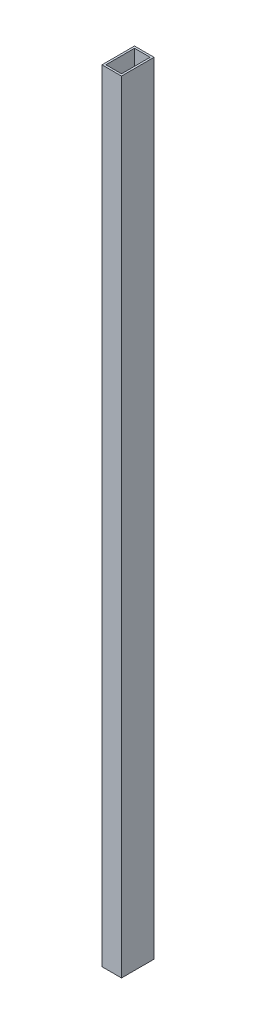
ISO-10303-21;
HEADER;
FILE_DESCRIPTION(('STEP AP214'),'2;1');
FILE_NAME('part.step','',(''),(''),'','','');
FILE_SCHEMA(('AUTOMOTIVE_DESIGN { 1 0 10303 214 1 1 1 1 }'));
ENDSEC;
DATA;
#1=APPLICATION_CONTEXT('core data for automotive mechanical design processes');
#2=APPLICATION_PROTOCOL_DEFINITION('international standard','automotive_design',2000,#1);
#3=PRODUCT_CONTEXT('',#1,'mechanical');
#4=PRODUCT('Part','Part','',(#3));
#5=PRODUCT_RELATED_PRODUCT_CATEGORY('part','',(#4));
#6=PRODUCT_DEFINITION_FORMATION('','',#4);
#7=PRODUCT_DEFINITION_CONTEXT('part definition',#1,'design');
#8=PRODUCT_DEFINITION('design','',#6,#7);
#9=PRODUCT_DEFINITION_SHAPE('','',#8);
#10=(LENGTH_UNIT() NAMED_UNIT(*) SI_UNIT(.MILLI.,.METRE.));
#11=(NAMED_UNIT(*) PLANE_ANGLE_UNIT() SI_UNIT($,.RADIAN.));
#12=(NAMED_UNIT(*) SI_UNIT($,.STERADIAN.) SOLID_ANGLE_UNIT());
#13=UNCERTAINTY_MEASURE_WITH_UNIT(LENGTH_MEASURE(1.E-05),#10,'distance_accuracy_value','');
#14=(GEOMETRIC_REPRESENTATION_CONTEXT(3) GLOBAL_UNCERTAINTY_ASSIGNED_CONTEXT((#13)) GLOBAL_UNIT_ASSIGNED_CONTEXT((#10,
#11,#12)) REPRESENTATION_CONTEXT('',''));
#15=CARTESIAN_POINT('',(0.,0.,0.));
#16=DIRECTION('',(0.,0.,1.));
#17=DIRECTION('',(1.,0.,0.));
#18=AXIS2_PLACEMENT_3D('',#15,#16,#17);
#19=CARTESIAN_POINT('',(0.,3048.,-127.));
#20=DIRECTION('',(0.,-1.,0.));
#21=DIRECTION('',(0.,0.,-1.));
#22=AXIS2_PLACEMENT_3D('',#19,#20,#21);
#23=PLANE('',#22);
#24=DIRECTION('',(0.,0.,1.));
#25=VECTOR('',#24,1.);
#26=CARTESIAN_POINT('',(0.,3048.,0.));
#27=LINE('',#26,#25);
#28=CARTESIAN_POINT('',(0.,3048.,-127.));
#29=VERTEX_POINT('',#28);
#30=CARTESIAN_POINT('',(0.,3048.,0.));
#31=VERTEX_POINT('',#30);
#32=EDGE_CURVE('E134',#29,#31,#27,.T.);
#33=ORIENTED_EDGE('',*,*,#32,.T.);
#34=DIRECTION('',(1.,0.,0.));
#35=VECTOR('',#34,1.);
#36=CARTESIAN_POINT('',(0.,3048.,0.));
#37=LINE('',#36,#35);
#38=CARTESIAN_POINT('',(76.2,3048.,0.));
#39=VERTEX_POINT('',#38);
#40=EDGE_CURVE('E137',#31,#39,#37,.T.);
#41=ORIENTED_EDGE('',*,*,#40,.T.);
#42=DIRECTION('',(0.,0.,-1.));
#43=VECTOR('',#42,1.);
#44=CARTESIAN_POINT('',(76.2,3048.,0.));
#45=LINE('',#44,#43);
#46=CARTESIAN_POINT('',(76.2,3048.,-127.));
#47=VERTEX_POINT('',#46);
#48=EDGE_CURVE('E140',#39,#47,#45,.T.);
#49=ORIENTED_EDGE('',*,*,#48,.T.);
#50=DIRECTION('',(-1.,0.,0.));
#51=VECTOR('',#50,1.);
#52=CARTESIAN_POINT('',(0.,3048.,-127.));
#53=LINE('',#52,#51);
#54=EDGE_CURVE('E142',#47,#29,#53,.T.);
#55=ORIENTED_EDGE('',*,*,#54,.T.);
#56=EDGE_LOOP('',(#33,#41,#49,#55));
#57=FACE_BOUND('',#56,.T.);
#58=DIRECTION('',(0.,0.,1.));
#59=VECTOR('',#58,1.);
#60=CARTESIAN_POINT('',(7.62,3048.,-7.62));
#61=LINE('',#60,#59);
#62=CARTESIAN_POINT('',(7.62,3048.,-119.38));
#63=VERTEX_POINT('',#62);
#64=CARTESIAN_POINT('',(7.62,3048.,-7.62));
#65=VERTEX_POINT('',#64);
#66=EDGE_CURVE('E98',#63,#65,#61,.T.);
#67=ORIENTED_EDGE('',*,*,#66,.F.);
#68=DIRECTION('',(-1.,0.,0.));
#69=VECTOR('',#68,1.);
#70=CARTESIAN_POINT('',(7.62,3048.,-119.38));
#71=LINE('',#70,#69);
#72=CARTESIAN_POINT('',(68.58,3048.,-119.38));
#73=VERTEX_POINT('',#72);
#74=EDGE_CURVE('E120',#73,#63,#71,.T.);
#75=ORIENTED_EDGE('',*,*,#74,.F.);
#76=DIRECTION('',(0.,0.,-1.));
#77=VECTOR('',#76,1.);
#78=CARTESIAN_POINT('',(68.58,3048.,-7.62));
#79=LINE('',#78,#77);
#80=CARTESIAN_POINT('',(68.58,3048.,-7.62));
#81=VERTEX_POINT('',#80);
#82=EDGE_CURVE('E118',#81,#73,#79,.T.);
#83=ORIENTED_EDGE('',*,*,#82,.F.);
#84=DIRECTION('',(1.,0.,0.));
#85=VECTOR('',#84,1.);
#86=CARTESIAN_POINT('',(7.62,3048.,-7.62));
#87=LINE('',#86,#85);
#88=EDGE_CURVE('E106',#65,#81,#87,.T.);
#89=ORIENTED_EDGE('',*,*,#88,.F.);
#90=EDGE_LOOP('',(#67,#75,#83,#89));
#91=FACE_BOUND('',#90,.T.);
#92=ADVANCED_FACE('F33',(#57,#91),#23,.F.);
#93=CARTESIAN_POINT('',(0.,0.,-127.));
#94=DIRECTION('',(0.,-1.,0.));
#95=DIRECTION('',(0.,0.,-1.));
#96=AXIS2_PLACEMENT_3D('',#93,#94,#95);
#97=PLANE('',#96);
#98=DIRECTION('',(0.,0.,1.));
#99=VECTOR('',#98,1.);
#100=CARTESIAN_POINT('',(0.,0.,0.));
#101=LINE('',#100,#99);
#102=CARTESIAN_POINT('',(0.,0.,-127.));
#103=VERTEX_POINT('',#102);
#104=CARTESIAN_POINT('',(0.,0.,0.));
#105=VERTEX_POINT('',#104);
#106=EDGE_CURVE('E114',#103,#105,#101,.T.);
#107=ORIENTED_EDGE('',*,*,#106,.F.);
#108=DIRECTION('',(-1.,0.,0.));
#109=VECTOR('',#108,1.);
#110=CARTESIAN_POINT('',(0.,0.,-127.));
#111=LINE('',#110,#109);
#112=CARTESIAN_POINT('',(76.2,0.,-127.));
#113=VERTEX_POINT('',#112);
#114=EDGE_CURVE('E138',#113,#103,#111,.T.);
#115=ORIENTED_EDGE('',*,*,#114,.F.);
#116=DIRECTION('',(0.,0.,-1.));
#117=VECTOR('',#116,1.);
#118=CARTESIAN_POINT('',(76.2,0.,0.));
#119=LINE('',#118,#117);
#120=CARTESIAN_POINT('',(76.2,0.,0.));
#121=VERTEX_POINT('',#120);
#122=EDGE_CURVE('E149',#121,#113,#119,.T.);
#123=ORIENTED_EDGE('',*,*,#122,.F.);
#124=DIRECTION('',(1.,0.,0.));
#125=VECTOR('',#124,1.);
#126=CARTESIAN_POINT('',(0.,0.,0.));
#127=LINE('',#126,#125);
#128=EDGE_CURVE('E147',#105,#121,#127,.T.);
#129=ORIENTED_EDGE('',*,*,#128,.F.);
#130=EDGE_LOOP('',(#107,#115,#123,#129));
#131=FACE_BOUND('',#130,.T.);
#132=DIRECTION('',(-1.,0.,0.));
#133=VECTOR('',#132,1.);
#134=CARTESIAN_POINT('',(7.62,0.,-119.38));
#135=LINE('',#134,#133);
#136=CARTESIAN_POINT('',(68.58,0.,-119.38));
#137=VERTEX_POINT('',#136);
#138=CARTESIAN_POINT('',(7.62,0.,-119.38));
#139=VERTEX_POINT('',#138);
#140=EDGE_CURVE('E107',#137,#139,#135,.T.);
#141=ORIENTED_EDGE('',*,*,#140,.T.);
#142=DIRECTION('',(0.,0.,1.));
#143=VECTOR('',#142,1.);
#144=CARTESIAN_POINT('',(7.62,0.,-7.62));
#145=LINE('',#144,#143);
#146=CARTESIAN_POINT('',(7.62,0.,-7.62));
#147=VERTEX_POINT('',#146);
#148=EDGE_CURVE('E56',#139,#147,#145,.T.);
#149=ORIENTED_EDGE('',*,*,#148,.T.);
#150=DIRECTION('',(1.,0.,0.));
#151=VECTOR('',#150,1.);
#152=CARTESIAN_POINT('',(7.62,0.,-7.62));
#153=LINE('',#152,#151);
#154=CARTESIAN_POINT('',(68.58,0.,-7.62));
#155=VERTEX_POINT('',#154);
#156=EDGE_CURVE('E113',#147,#155,#153,.T.);
#157=ORIENTED_EDGE('',*,*,#156,.T.);
#158=DIRECTION('',(0.,0.,-1.));
#159=VECTOR('',#158,1.);
#160=CARTESIAN_POINT('',(68.58,0.,-7.62));
#161=LINE('',#160,#159);
#162=EDGE_CURVE('E126',#155,#137,#161,.T.);
#163=ORIENTED_EDGE('',*,*,#162,.T.);
#164=EDGE_LOOP('',(#141,#149,#157,#163));
#165=FACE_BOUND('',#164,.T.);
#166=ADVANCED_FACE('F167',(#131,#165),#97,.T.);
#167=CARTESIAN_POINT('',(0.,3048.,0.));
#168=DIRECTION('',(1.,0.,0.));
#169=DIRECTION('',(0.,0.,-1.));
#170=AXIS2_PLACEMENT_3D('',#167,#168,#169);
#171=PLANE('',#170);
#172=ORIENTED_EDGE('',*,*,#106,.T.);
#173=DIRECTION('',(0.,-1.,0.));
#174=VECTOR('',#173,1.);
#175=CARTESIAN_POINT('',(0.,3048.,0.));
#176=LINE('',#175,#174);
#177=EDGE_CURVE('E11',#31,#105,#176,.T.);
#178=ORIENTED_EDGE('',*,*,#177,.F.);
#179=ORIENTED_EDGE('',*,*,#32,.F.);
#180=DIRECTION('',(0.,-1.,0.));
#181=VECTOR('',#180,1.);
#182=CARTESIAN_POINT('',(0.,3048.,-127.));
#183=LINE('',#182,#181);
#184=EDGE_CURVE('E144',#29,#103,#183,.T.);
#185=ORIENTED_EDGE('',*,*,#184,.T.);
#186=EDGE_LOOP('',(#172,#178,#179,#185));
#187=FACE_BOUND('',#186,.T.);
#188=ADVANCED_FACE('F35',(#187),#171,.F.);
#189=CARTESIAN_POINT('',(0.,3048.,0.));
#190=DIRECTION('',(0.,0.,-1.));
#191=DIRECTION('',(-1.,0.,0.));
#192=AXIS2_PLACEMENT_3D('',#189,#190,#191);
#193=PLANE('',#192);
#194=ORIENTED_EDGE('',*,*,#128,.T.);
#195=DIRECTION('',(0.,-1.,0.));
#196=VECTOR('',#195,1.);
#197=CARTESIAN_POINT('',(76.2,3048.,0.));
#198=LINE('',#197,#196);
#199=EDGE_CURVE('E41',#39,#121,#198,.T.);
#200=ORIENTED_EDGE('',*,*,#199,.F.);
#201=ORIENTED_EDGE('',*,*,#40,.F.);
#202=ORIENTED_EDGE('',*,*,#177,.T.);
#203=EDGE_LOOP('',(#194,#200,#201,#202));
#204=FACE_BOUND('',#203,.T.);
#205=ADVANCED_FACE('F177',(#204),#193,.F.);
#206=CARTESIAN_POINT('',(76.2,3048.,0.));
#207=DIRECTION('',(-1.,0.,0.));
#208=DIRECTION('',(0.,0.,1.));
#209=AXIS2_PLACEMENT_3D('',#206,#207,#208);
#210=PLANE('',#209);
#211=ORIENTED_EDGE('',*,*,#122,.T.);
#212=DIRECTION('',(0.,-1.,0.));
#213=VECTOR('',#212,1.);
#214=CARTESIAN_POINT('',(76.2,3048.,-127.));
#215=LINE('',#214,#213);
#216=EDGE_CURVE('E154',#47,#113,#215,.T.);
#217=ORIENTED_EDGE('',*,*,#216,.F.);
#218=ORIENTED_EDGE('',*,*,#48,.F.);
#219=ORIENTED_EDGE('',*,*,#199,.T.);
#220=EDGE_LOOP('',(#211,#217,#218,#219));
#221=FACE_BOUND('',#220,.T.);
#222=ADVANCED_FACE('F161',(#221),#210,.F.);
#223=CARTESIAN_POINT('',(0.,3048.,-127.));
#224=DIRECTION('',(0.,0.,1.));
#225=DIRECTION('',(1.,0.,0.));
#226=AXIS2_PLACEMENT_3D('',#223,#224,#225);
#227=PLANE('',#226);
#228=ORIENTED_EDGE('',*,*,#114,.T.);
#229=ORIENTED_EDGE('',*,*,#184,.F.);
#230=ORIENTED_EDGE('',*,*,#54,.F.);
#231=ORIENTED_EDGE('',*,*,#216,.T.);
#232=EDGE_LOOP('',(#228,#229,#230,#231));
#233=FACE_BOUND('',#232,.T.);
#234=ADVANCED_FACE('F171',(#233),#227,.F.);
#235=CARTESIAN_POINT('',(7.62,3048.,-7.62));
#236=DIRECTION('',(1.,0.,0.));
#237=DIRECTION('',(0.,0.,-1.));
#238=AXIS2_PLACEMENT_3D('',#235,#236,#237);
#239=PLANE('',#238);
#240=ORIENTED_EDGE('',*,*,#148,.F.);
#241=DIRECTION('',(0.,-1.,0.));
#242=VECTOR('',#241,1.);
#243=CARTESIAN_POINT('',(7.62,3048.,-119.38));
#244=LINE('',#243,#242);
#245=EDGE_CURVE('E102',#63,#139,#244,.T.);
#246=ORIENTED_EDGE('',*,*,#245,.F.);
#247=ORIENTED_EDGE('',*,*,#66,.T.);
#248=DIRECTION('',(0.,-1.,0.));
#249=VECTOR('',#248,1.);
#250=CARTESIAN_POINT('',(7.62,3048.,-7.62));
#251=LINE('',#250,#249);
#252=EDGE_CURVE('E101',#65,#147,#251,.T.);
#253=ORIENTED_EDGE('',*,*,#252,.T.);
#254=EDGE_LOOP('',(#240,#246,#247,#253));
#255=FACE_BOUND('',#254,.T.);
#256=ADVANCED_FACE('F100',(#255),#239,.T.);
#257=CARTESIAN_POINT('',(7.62,3048.,-7.62));
#258=DIRECTION('',(0.,0.,-1.));
#259=DIRECTION('',(-1.,0.,0.));
#260=AXIS2_PLACEMENT_3D('',#257,#258,#259);
#261=PLANE('',#260);
#262=ORIENTED_EDGE('',*,*,#156,.F.);
#263=ORIENTED_EDGE('',*,*,#252,.F.);
#264=ORIENTED_EDGE('',*,*,#88,.T.);
#265=DIRECTION('',(0.,-1.,0.));
#266=VECTOR('',#265,1.);
#267=CARTESIAN_POINT('',(68.58,3048.,-7.62));
#268=LINE('',#267,#266);
#269=EDGE_CURVE('E115',#81,#155,#268,.T.);
#270=ORIENTED_EDGE('',*,*,#269,.T.);
#271=EDGE_LOOP('',(#262,#263,#264,#270));
#272=FACE_BOUND('',#271,.T.);
#273=ADVANCED_FACE('F110',(#272),#261,.T.);
#274=CARTESIAN_POINT('',(68.58,3048.,-7.62));
#275=DIRECTION('',(-1.,0.,0.));
#276=DIRECTION('',(0.,0.,1.));
#277=AXIS2_PLACEMENT_3D('',#274,#275,#276);
#278=PLANE('',#277);
#279=ORIENTED_EDGE('',*,*,#162,.F.);
#280=ORIENTED_EDGE('',*,*,#269,.F.);
#281=ORIENTED_EDGE('',*,*,#82,.T.);
#282=DIRECTION('',(0.,-1.,0.));
#283=VECTOR('',#282,1.);
#284=CARTESIAN_POINT('',(68.58,3048.,-119.38));
#285=LINE('',#284,#283);
#286=EDGE_CURVE('E48',#73,#137,#285,.T.);
#287=ORIENTED_EDGE('',*,*,#286,.T.);
#288=EDGE_LOOP('',(#279,#280,#281,#287));
#289=FACE_BOUND('',#288,.T.);
#290=ADVANCED_FACE('F200',(#289),#278,.T.);
#291=CARTESIAN_POINT('',(7.62,3048.,-119.38));
#292=DIRECTION('',(0.,0.,1.));
#293=DIRECTION('',(1.,0.,0.));
#294=AXIS2_PLACEMENT_3D('',#291,#292,#293);
#295=PLANE('',#294);
#296=ORIENTED_EDGE('',*,*,#140,.F.);
#297=ORIENTED_EDGE('',*,*,#286,.F.);
#298=ORIENTED_EDGE('',*,*,#74,.T.);
#299=ORIENTED_EDGE('',*,*,#245,.T.);
#300=EDGE_LOOP('',(#296,#297,#298,#299));
#301=FACE_BOUND('',#300,.T.);
#302=ADVANCED_FACE('F204',(#301),#295,.T.);
#303=CLOSED_SHELL('',(#92,#166,#188,#205,#222,#234,#256,#273,#290,#302));
#304=MANIFOLD_SOLID_BREP('B2',#303);
#305=ADVANCED_BREP_SHAPE_REPRESENTATION('',(#18,#304),#14);
#306=SHAPE_DEFINITION_REPRESENTATION(#9,#305);
ENDSEC;
END-ISO-10303-21;
